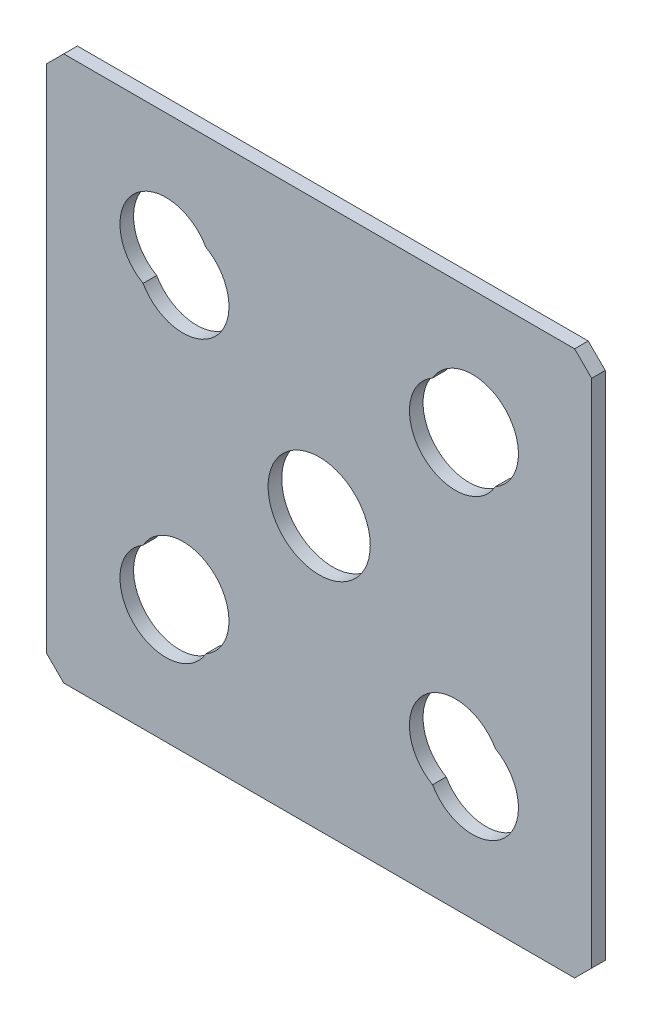
ISO-10303-21;
HEADER;
FILE_DESCRIPTION(('STEP AP214'),'2;1');
FILE_NAME('part.step','',(''),(''),'','','');
FILE_SCHEMA(('AUTOMOTIVE_DESIGN { 1 0 10303 214 1 1 1 1 }'));
ENDSEC;
DATA;
#1=APPLICATION_CONTEXT('core data for automotive mechanical design processes');
#2=APPLICATION_PROTOCOL_DEFINITION('international standard','automotive_design',2000,#1);
#3=PRODUCT_CONTEXT('',#1,'mechanical');
#4=PRODUCT('Part','Part','',(#3));
#5=PRODUCT_RELATED_PRODUCT_CATEGORY('part','',(#4));
#6=PRODUCT_DEFINITION_FORMATION('','',#4);
#7=PRODUCT_DEFINITION_CONTEXT('part definition',#1,'design');
#8=PRODUCT_DEFINITION('design','',#6,#7);
#9=PRODUCT_DEFINITION_SHAPE('','',#8);
#10=(LENGTH_UNIT() NAMED_UNIT(*) SI_UNIT(.MILLI.,.METRE.));
#11=(NAMED_UNIT(*) PLANE_ANGLE_UNIT() SI_UNIT($,.RADIAN.));
#12=(NAMED_UNIT(*) SI_UNIT($,.STERADIAN.) SOLID_ANGLE_UNIT());
#13=UNCERTAINTY_MEASURE_WITH_UNIT(LENGTH_MEASURE(1.E-05),#10,'distance_accuracy_value','');
#14=(GEOMETRIC_REPRESENTATION_CONTEXT(3) GLOBAL_UNCERTAINTY_ASSIGNED_CONTEXT((#13)) GLOBAL_UNIT_ASSIGNED_CONTEXT((#10,
#11,#12)) REPRESENTATION_CONTEXT('',''));
#15=CARTESIAN_POINT('',(0.,0.,0.));
#16=DIRECTION('',(0.,0.,1.));
#17=DIRECTION('',(1.,0.,0.));
#18=AXIS2_PLACEMENT_3D('',#15,#16,#17);
#19=CARTESIAN_POINT('',(-40.,-40.,-2.));
#20=DIRECTION('',(-1.,0.,0.));
#21=DIRECTION('',(0.,0.,1.));
#22=AXIS2_PLACEMENT_3D('',#19,#20,#21);
#23=PLANE('',#22);
#24=DIRECTION('',(0.,-1.,0.));
#25=VECTOR('',#24,1.);
#26=CARTESIAN_POINT('',(-40.,-40.,-2.));
#27=LINE('',#26,#25);
#28=CARTESIAN_POINT('',(-40.,37.5,-2.));
#29=VERTEX_POINT('',#28);
#30=CARTESIAN_POINT('',(-40.,-37.5,-2.));
#31=VERTEX_POINT('',#30);
#32=EDGE_CURVE('E186',#29,#31,#27,.T.);
#33=ORIENTED_EDGE('',*,*,#32,.T.);
#34=DIRECTION('',(0.,0.,1.));
#35=VECTOR('',#34,1.);
#36=CARTESIAN_POINT('',(-40.,-37.5,-2.));
#37=LINE('',#36,#35);
#38=CARTESIAN_POINT('',(-40.,-37.5,0.));
#39=VERTEX_POINT('',#38);
#40=EDGE_CURVE('E11',#31,#39,#37,.T.);
#41=ORIENTED_EDGE('',*,*,#40,.T.);
#42=DIRECTION('',(0.,-1.,0.));
#43=VECTOR('',#42,1.);
#44=CARTESIAN_POINT('',(-40.,-40.,0.));
#45=LINE('',#44,#43);
#46=CARTESIAN_POINT('',(-40.,37.5,0.));
#47=VERTEX_POINT('',#46);
#48=EDGE_CURVE('E178',#47,#39,#45,.T.);
#49=ORIENTED_EDGE('',*,*,#48,.F.);
#50=DIRECTION('',(0.,0.,-1.));
#51=VECTOR('',#50,1.);
#52=CARTESIAN_POINT('',(-40.,37.5,-2.));
#53=LINE('',#52,#51);
#54=EDGE_CURVE('E47',#47,#29,#53,.T.);
#55=ORIENTED_EDGE('',*,*,#54,.T.);
#56=EDGE_LOOP('',(#33,#41,#49,#55));
#57=FACE_BOUND('',#56,.T.);
#58=ADVANCED_FACE('F39',(#57),#23,.T.);
#59=CARTESIAN_POINT('',(40.,40.,-2.));
#60=DIRECTION('',(0.,1.,0.));
#61=DIRECTION('',(-1.,0.,0.));
#62=AXIS2_PLACEMENT_3D('',#59,#60,#61);
#63=PLANE('',#62);
#64=DIRECTION('',(-1.,0.,0.));
#65=VECTOR('',#64,1.);
#66=CARTESIAN_POINT('',(40.,40.,0.));
#67=LINE('',#66,#65);
#68=CARTESIAN_POINT('',(37.5,40.,0.));
#69=VERTEX_POINT('',#68);
#70=CARTESIAN_POINT('',(-37.5,40.,0.));
#71=VERTEX_POINT('',#70);
#72=EDGE_CURVE('E190',#69,#71,#67,.T.);
#73=ORIENTED_EDGE('',*,*,#72,.F.);
#74=DIRECTION('',(0.,0.,-1.));
#75=VECTOR('',#74,1.);
#76=CARTESIAN_POINT('',(37.5,40.,-2.));
#77=LINE('',#76,#75);
#78=CARTESIAN_POINT('',(37.5,40.,-2.));
#79=VERTEX_POINT('',#78);
#80=EDGE_CURVE('E242',#69,#79,#77,.T.);
#81=ORIENTED_EDGE('',*,*,#80,.T.);
#82=DIRECTION('',(-1.,0.,0.));
#83=VECTOR('',#82,1.);
#84=CARTESIAN_POINT('',(40.,40.,-2.));
#85=LINE('',#84,#83);
#86=CARTESIAN_POINT('',(-37.5,40.,-2.));
#87=VERTEX_POINT('',#86);
#88=EDGE_CURVE('E195',#79,#87,#85,.T.);
#89=ORIENTED_EDGE('',*,*,#88,.T.);
#90=DIRECTION('',(0.,0.,1.));
#91=VECTOR('',#90,1.);
#92=CARTESIAN_POINT('',(-37.5,40.,-2.));
#93=LINE('',#92,#91);
#94=EDGE_CURVE('E239',#87,#71,#93,.T.);
#95=ORIENTED_EDGE('',*,*,#94,.T.);
#96=EDGE_LOOP('',(#73,#81,#89,#95));
#97=FACE_BOUND('',#96,.T.);
#98=ADVANCED_FACE('F267',(#97),#63,.T.);
#99=CARTESIAN_POINT('',(40.,-40.,-2.));
#100=DIRECTION('',(1.,0.,0.));
#101=DIRECTION('',(0.,0.,-1.));
#102=AXIS2_PLACEMENT_3D('',#99,#100,#101);
#103=PLANE('',#102);
#104=DIRECTION('',(0.,1.,0.));
#105=VECTOR('',#104,1.);
#106=CARTESIAN_POINT('',(40.,-40.,-2.));
#107=LINE('',#106,#105);
#108=CARTESIAN_POINT('',(40.,-37.5,-2.));
#109=VERTEX_POINT('',#108);
#110=CARTESIAN_POINT('',(40.,37.5,-2.));
#111=VERTEX_POINT('',#110);
#112=EDGE_CURVE('E192',#109,#111,#107,.T.);
#113=ORIENTED_EDGE('',*,*,#112,.T.);
#114=DIRECTION('',(0.,0.,1.));
#115=VECTOR('',#114,1.);
#116=CARTESIAN_POINT('',(40.,37.5,-2.));
#117=LINE('',#116,#115);
#118=CARTESIAN_POINT('',(40.,37.5,0.));
#119=VERTEX_POINT('',#118);
#120=EDGE_CURVE('E228',#111,#119,#117,.T.);
#121=ORIENTED_EDGE('',*,*,#120,.T.);
#122=DIRECTION('',(0.,1.,0.));
#123=VECTOR('',#122,1.);
#124=CARTESIAN_POINT('',(40.,-40.,0.));
#125=LINE('',#124,#123);
#126=CARTESIAN_POINT('',(40.,-37.5,0.));
#127=VERTEX_POINT('',#126);
#128=EDGE_CURVE('E204',#127,#119,#125,.T.);
#129=ORIENTED_EDGE('',*,*,#128,.F.);
#130=DIRECTION('',(0.,0.,-1.));
#131=VECTOR('',#130,1.);
#132=CARTESIAN_POINT('',(40.,-37.5,-2.));
#133=LINE('',#132,#131);
#134=EDGE_CURVE('E172',#127,#109,#133,.T.);
#135=ORIENTED_EDGE('',*,*,#134,.T.);
#136=EDGE_LOOP('',(#113,#121,#129,#135));
#137=FACE_BOUND('',#136,.T.);
#138=ADVANCED_FACE('F276',(#137),#103,.T.);
#139=CARTESIAN_POINT('',(40.,-40.,-2.));
#140=DIRECTION('',(0.,-1.,0.));
#141=DIRECTION('',(1.,0.,0.));
#142=AXIS2_PLACEMENT_3D('',#139,#140,#141);
#143=PLANE('',#142);
#144=DIRECTION('',(1.,0.,0.));
#145=VECTOR('',#144,1.);
#146=CARTESIAN_POINT('',(40.,-40.,-2.));
#147=LINE('',#146,#145);
#148=CARTESIAN_POINT('',(-37.5,-40.,-2.));
#149=VERTEX_POINT('',#148);
#150=CARTESIAN_POINT('',(37.5,-40.,-2.));
#151=VERTEX_POINT('',#150);
#152=EDGE_CURVE('E189',#149,#151,#147,.T.);
#153=ORIENTED_EDGE('',*,*,#152,.T.);
#154=DIRECTION('',(0.,0.,1.));
#155=VECTOR('',#154,1.);
#156=CARTESIAN_POINT('',(37.5,-40.,-2.));
#157=LINE('',#156,#155);
#158=CARTESIAN_POINT('',(37.5,-40.,0.));
#159=VERTEX_POINT('',#158);
#160=EDGE_CURVE('E252',#151,#159,#157,.T.);
#161=ORIENTED_EDGE('',*,*,#160,.T.);
#162=DIRECTION('',(1.,0.,0.));
#163=VECTOR('',#162,1.);
#164=CARTESIAN_POINT('',(40.,-40.,0.));
#165=LINE('',#164,#163);
#166=CARTESIAN_POINT('',(-37.5,-40.,0.));
#167=VERTEX_POINT('',#166);
#168=EDGE_CURVE('E201',#167,#159,#165,.T.);
#169=ORIENTED_EDGE('',*,*,#168,.F.);
#170=DIRECTION('',(0.,0.,-1.));
#171=VECTOR('',#170,1.);
#172=CARTESIAN_POINT('',(-37.5,-40.,-2.));
#173=LINE('',#172,#171);
#174=EDGE_CURVE('E61',#167,#149,#173,.T.);
#175=ORIENTED_EDGE('',*,*,#174,.T.);
#176=EDGE_LOOP('',(#153,#161,#169,#175));
#177=FACE_BOUND('',#176,.T.);
#178=ADVANCED_FACE('F281',(#177),#143,.T.);
#179=CARTESIAN_POINT('',(0.,0.,-2.));
#180=DIRECTION('',(0.,0.,1.));
#181=DIRECTION('',(1.,0.,0.));
#182=AXIS2_PLACEMENT_3D('',#179,#180,#181);
#183=PLANE('',#182);
#184=CARTESIAN_POINT('',(0.,0.,-2.));
#185=DIRECTION('',(0.,0.,1.));
#186=DIRECTION('',(1.,0.,0.));
#187=AXIS2_PLACEMENT_3D('',#184,#185,#186);
#188=CIRCLE('',#187,7.5);
#189=CARTESIAN_POINT('',(7.5,0.,-2.));
#190=VERTEX_POINT('',#189);
#191=EDGE_CURVE('E164',#190,#190,#188,.T.);
#192=ORIENTED_EDGE('',*,*,#191,.T.);
#193=EDGE_LOOP('',(#192));
#194=FACE_BOUND('',#193,.T.);
#195=CARTESIAN_POINT('',(-22.5,22.5,-2.));
#196=DIRECTION('',(0.,0.,1.));
#197=DIRECTION('',(1.,0.,0.));
#198=AXIS2_PLACEMENT_3D('',#195,#196,#197);
#199=CIRCLE('',#198,6.75);
#200=CARTESIAN_POINT('',(-16.643618556828,25.8563814431721,-2.));
#201=VERTEX_POINT('',#200);
#202=CARTESIAN_POINT('',(-25.856381443172,16.6436185568279,-2.));
#203=VERTEX_POINT('',#202);
#204=EDGE_CURVE('E491',#201,#203,#199,.T.);
#205=ORIENTED_EDGE('',*,*,#204,.T.);
#206=CARTESIAN_POINT('',(-20.,20.,-2.));
#207=DIRECTION('',(0.,0.,1.));
#208=DIRECTION('',(1.,0.,0.));
#209=AXIS2_PLACEMENT_3D('',#206,#207,#208);
#210=CIRCLE('',#209,6.75);
#211=EDGE_CURVE('E485',#203,#201,#210,.T.);
#212=ORIENTED_EDGE('',*,*,#211,.T.);
#213=EDGE_LOOP('',(#205,#212));
#214=FACE_BOUND('',#213,.T.);
#215=CARTESIAN_POINT('',(22.5,-22.5,-2.));
#216=DIRECTION('',(0.,0.,1.));
#217=DIRECTION('',(1.,0.,0.));
#218=AXIS2_PLACEMENT_3D('',#215,#216,#217);
#219=CIRCLE('',#218,6.75);
#220=CARTESIAN_POINT('',(16.6436185568279,-25.8563814431721,-2.));
#221=VERTEX_POINT('',#220);
#222=CARTESIAN_POINT('',(25.8563814431721,-16.6436185568279,-2.));
#223=VERTEX_POINT('',#222);
#224=EDGE_CURVE('E496',#221,#223,#219,.T.);
#225=ORIENTED_EDGE('',*,*,#224,.T.);
#226=CARTESIAN_POINT('',(20.,-20.,-2.));
#227=DIRECTION('',(0.,0.,1.));
#228=DIRECTION('',(1.,0.,0.));
#229=AXIS2_PLACEMENT_3D('',#226,#227,#228);
#230=CIRCLE('',#229,6.75);
#231=EDGE_CURVE('E480',#223,#221,#230,.T.);
#232=ORIENTED_EDGE('',*,*,#231,.T.);
#233=EDGE_LOOP('',(#225,#232));
#234=FACE_BOUND('',#233,.T.);
#235=CARTESIAN_POINT('',(22.5,22.5,-2.));
#236=DIRECTION('',(0.,0.,1.));
#237=DIRECTION('',(1.,0.,0.));
#238=AXIS2_PLACEMENT_3D('',#235,#236,#237);
#239=CIRCLE('',#238,6.75);
#240=CARTESIAN_POINT('',(25.8563814431721,16.6436185568279,-2.));
#241=VERTEX_POINT('',#240);
#242=CARTESIAN_POINT('',(16.6436185568279,25.856381443172,-2.));
#243=VERTEX_POINT('',#242);
#244=EDGE_CURVE('E176',#241,#243,#239,.T.);
#245=ORIENTED_EDGE('',*,*,#244,.T.);
#246=CARTESIAN_POINT('',(20.,20.,-2.));
#247=DIRECTION('',(0.,0.,1.));
#248=DIRECTION('',(1.,0.,0.));
#249=AXIS2_PLACEMENT_3D('',#246,#247,#248);
#250=CIRCLE('',#249,6.75);
#251=EDGE_CURVE('E475',#243,#241,#250,.T.);
#252=ORIENTED_EDGE('',*,*,#251,.T.);
#253=EDGE_LOOP('',(#245,#252));
#254=FACE_BOUND('',#253,.T.);
#255=CARTESIAN_POINT('',(-22.5,-22.5,-2.));
#256=DIRECTION('',(0.,0.,1.));
#257=DIRECTION('',(1.,0.,0.));
#258=AXIS2_PLACEMENT_3D('',#255,#256,#257);
#259=CIRCLE('',#258,6.75);
#260=CARTESIAN_POINT('',(-25.8563814431721,-16.6436185568279,-2.));
#261=VERTEX_POINT('',#260);
#262=CARTESIAN_POINT('',(-16.643618556828,-25.8563814431721,-2.));
#263=VERTEX_POINT('',#262);
#264=EDGE_CURVE('E171',#261,#263,#259,.T.);
#265=ORIENTED_EDGE('',*,*,#264,.T.);
#266=CARTESIAN_POINT('',(-20.,-20.,-2.));
#267=DIRECTION('',(0.,0.,1.));
#268=DIRECTION('',(1.,0.,0.));
#269=AXIS2_PLACEMENT_3D('',#266,#267,#268);
#270=CIRCLE('',#269,6.75);
#271=EDGE_CURVE('E163',#263,#261,#270,.T.);
#272=ORIENTED_EDGE('',*,*,#271,.T.);
#273=EDGE_LOOP('',(#265,#272));
#274=FACE_BOUND('',#273,.T.);
#275=ORIENTED_EDGE('',*,*,#88,.F.);
#276=DIRECTION('',(-0.707106781186548,0.707106781186548,0.));
#277=VECTOR('',#276,1.);
#278=CARTESIAN_POINT('',(40.,37.5,-2.));
#279=LINE('',#278,#277);
#280=EDGE_CURVE('E249',#79,#111,#279,.F.);
#281=ORIENTED_EDGE('',*,*,#280,.T.);
#282=ORIENTED_EDGE('',*,*,#112,.F.);
#283=DIRECTION('',(0.707106781186546,0.707106781186549,0.));
#284=VECTOR('',#283,1.);
#285=CARTESIAN_POINT('',(37.5,-40.,-2.));
#286=LINE('',#285,#284);
#287=EDGE_CURVE('E54',#109,#151,#286,.F.);
#288=ORIENTED_EDGE('',*,*,#287,.T.);
#289=ORIENTED_EDGE('',*,*,#152,.F.);
#290=DIRECTION('',(0.707106781186548,-0.707106781186548,0.));
#291=VECTOR('',#290,1.);
#292=CARTESIAN_POINT('',(-40.,-37.5,-2.));
#293=LINE('',#292,#291);
#294=EDGE_CURVE('E246',#149,#31,#293,.F.);
#295=ORIENTED_EDGE('',*,*,#294,.T.);
#296=ORIENTED_EDGE('',*,*,#32,.F.);
#297=DIRECTION('',(-0.707106781186545,-0.70710678118655,0.));
#298=VECTOR('',#297,1.);
#299=CARTESIAN_POINT('',(-37.5,40.,-2.));
#300=LINE('',#299,#298);
#301=EDGE_CURVE('E244',#29,#87,#300,.F.);
#302=ORIENTED_EDGE('',*,*,#301,.T.);
#303=EDGE_LOOP('',(#275,#281,#282,#288,#289,#295,#296,#302));
#304=FACE_BOUND('',#303,.T.);
#305=ADVANCED_FACE('F262',(#194,#214,#234,#254,#274,#304),#183,.F.);
#306=CARTESIAN_POINT('',(0.,0.,0.));
#307=DIRECTION('',(0.,0.,1.));
#308=DIRECTION('',(1.,0.,0.));
#309=AXIS2_PLACEMENT_3D('',#306,#307,#308);
#310=PLANE('',#309);
#311=CARTESIAN_POINT('',(0.,0.,0.));
#312=DIRECTION('',(0.,0.,1.));
#313=DIRECTION('',(1.,0.,0.));
#314=AXIS2_PLACEMENT_3D('',#311,#312,#313);
#315=CIRCLE('',#314,7.5);
#316=CARTESIAN_POINT('',(7.5,0.,0.));
#317=VERTEX_POINT('',#316);
#318=EDGE_CURVE('E467',#317,#317,#315,.T.);
#319=ORIENTED_EDGE('',*,*,#318,.F.);
#320=EDGE_LOOP('',(#319));
#321=FACE_BOUND('',#320,.T.);
#322=CARTESIAN_POINT('',(-20.,-20.,0.));
#323=DIRECTION('',(0.,0.,1.));
#324=DIRECTION('',(1.,0.,0.));
#325=AXIS2_PLACEMENT_3D('',#322,#323,#324);
#326=CIRCLE('',#325,6.75);
#327=CARTESIAN_POINT('',(-16.643618556828,-25.8563814431721,0.));
#328=VERTEX_POINT('',#327);
#329=CARTESIAN_POINT('',(-25.8563814431721,-16.6436185568279,0.));
#330=VERTEX_POINT('',#329);
#331=EDGE_CURVE('E153',#328,#330,#326,.T.);
#332=ORIENTED_EDGE('',*,*,#331,.F.);
#333=CARTESIAN_POINT('',(-22.5,-22.5,0.));
#334=DIRECTION('',(0.,0.,1.));
#335=DIRECTION('',(1.,0.,0.));
#336=AXIS2_PLACEMENT_3D('',#333,#334,#335);
#337=CIRCLE('',#336,6.75);
#338=EDGE_CURVE('E169',#330,#328,#337,.T.);
#339=ORIENTED_EDGE('',*,*,#338,.F.);
#340=EDGE_LOOP('',(#332,#339));
#341=FACE_BOUND('',#340,.T.);
#342=CARTESIAN_POINT('',(20.,20.,0.));
#343=DIRECTION('',(0.,0.,1.));
#344=DIRECTION('',(1.,0.,0.));
#345=AXIS2_PLACEMENT_3D('',#342,#343,#344);
#346=CIRCLE('',#345,6.75);
#347=CARTESIAN_POINT('',(16.6436185568279,25.856381443172,0.));
#348=VERTEX_POINT('',#347);
#349=CARTESIAN_POINT('',(25.8563814431721,16.6436185568279,0.));
#350=VERTEX_POINT('',#349);
#351=EDGE_CURVE('E473',#348,#350,#346,.T.);
#352=ORIENTED_EDGE('',*,*,#351,.F.);
#353=CARTESIAN_POINT('',(22.5,22.5,0.));
#354=DIRECTION('',(0.,0.,1.));
#355=DIRECTION('',(1.,0.,0.));
#356=AXIS2_PLACEMENT_3D('',#353,#354,#355);
#357=CIRCLE('',#356,6.75);
#358=EDGE_CURVE('E181',#350,#348,#357,.T.);
#359=ORIENTED_EDGE('',*,*,#358,.F.);
#360=EDGE_LOOP('',(#352,#359));
#361=FACE_BOUND('',#360,.T.);
#362=CARTESIAN_POINT('',(20.,-20.,0.));
#363=DIRECTION('',(0.,0.,1.));
#364=DIRECTION('',(1.,0.,0.));
#365=AXIS2_PLACEMENT_3D('',#362,#363,#364);
#366=CIRCLE('',#365,6.75);
#367=CARTESIAN_POINT('',(25.8563814431721,-16.6436185568279,0.));
#368=VERTEX_POINT('',#367);
#369=CARTESIAN_POINT('',(16.6436185568279,-25.8563814431721,0.));
#370=VERTEX_POINT('',#369);
#371=EDGE_CURVE('E478',#368,#370,#366,.T.);
#372=ORIENTED_EDGE('',*,*,#371,.F.);
#373=CARTESIAN_POINT('',(22.5,-22.5,0.));
#374=DIRECTION('',(0.,0.,1.));
#375=DIRECTION('',(1.,0.,0.));
#376=AXIS2_PLACEMENT_3D('',#373,#374,#375);
#377=CIRCLE('',#376,6.75);
#378=EDGE_CURVE('E494',#370,#368,#377,.T.);
#379=ORIENTED_EDGE('',*,*,#378,.F.);
#380=EDGE_LOOP('',(#372,#379));
#381=FACE_BOUND('',#380,.T.);
#382=CARTESIAN_POINT('',(-20.,20.,0.));
#383=DIRECTION('',(0.,0.,1.));
#384=DIRECTION('',(1.,0.,0.));
#385=AXIS2_PLACEMENT_3D('',#382,#383,#384);
#386=CIRCLE('',#385,6.75);
#387=CARTESIAN_POINT('',(-25.856381443172,16.6436185568279,0.));
#388=VERTEX_POINT('',#387);
#389=CARTESIAN_POINT('',(-16.643618556828,25.8563814431721,0.));
#390=VERTEX_POINT('',#389);
#391=EDGE_CURVE('E483',#388,#390,#386,.T.);
#392=ORIENTED_EDGE('',*,*,#391,.F.);
#393=CARTESIAN_POINT('',(-22.5,22.5,0.));
#394=DIRECTION('',(0.,0.,1.));
#395=DIRECTION('',(1.,0.,0.));
#396=AXIS2_PLACEMENT_3D('',#393,#394,#395);
#397=CIRCLE('',#396,6.75);
#398=EDGE_CURVE('E488',#390,#388,#397,.T.);
#399=ORIENTED_EDGE('',*,*,#398,.F.);
#400=EDGE_LOOP('',(#392,#399));
#401=FACE_BOUND('',#400,.T.);
#402=ORIENTED_EDGE('',*,*,#128,.T.);
#403=DIRECTION('',(0.707106781186548,-0.707106781186548,0.));
#404=VECTOR('',#403,1.);
#405=CARTESIAN_POINT('',(38.75,38.75,0.));
#406=LINE('',#405,#404);
#407=EDGE_CURVE('E237',#119,#69,#406,.F.);
#408=ORIENTED_EDGE('',*,*,#407,.T.);
#409=ORIENTED_EDGE('',*,*,#72,.T.);
#410=DIRECTION('',(0.707106781186545,0.70710678118655,0.));
#411=VECTOR('',#410,1.);
#412=CARTESIAN_POINT('',(-38.7500000000001,38.7499999999998,0.));
#413=LINE('',#412,#411);
#414=EDGE_CURVE('E231',#71,#47,#413,.F.);
#415=ORIENTED_EDGE('',*,*,#414,.T.);
#416=ORIENTED_EDGE('',*,*,#48,.T.);
#417=DIRECTION('',(-0.707106781186548,0.707106781186548,0.));
#418=VECTOR('',#417,1.);
#419=CARTESIAN_POINT('',(-38.75,-38.75,0.));
#420=LINE('',#419,#418);
#421=EDGE_CURVE('E233',#39,#167,#420,.F.);
#422=ORIENTED_EDGE('',*,*,#421,.T.);
#423=ORIENTED_EDGE('',*,*,#168,.T.);
#424=DIRECTION('',(-0.707106781186546,-0.707106781186549,0.));
#425=VECTOR('',#424,1.);
#426=CARTESIAN_POINT('',(38.7500000000001,-38.7499999999999,0.));
#427=LINE('',#426,#425);
#428=EDGE_CURVE('E235',#159,#127,#427,.F.);
#429=ORIENTED_EDGE('',*,*,#428,.T.);
#430=EDGE_LOOP('',(#402,#408,#409,#415,#416,#422,#423,#429));
#431=FACE_BOUND('',#430,.T.);
#432=ADVANCED_FACE('F174',(#321,#341,#361,#381,#401,#431),#310,.T.);
#433=CARTESIAN_POINT('',(-22.5,-22.5,0.));
#434=DIRECTION('',(0.,0.,1.));
#435=DIRECTION('',(1.,0.,0.));
#436=AXIS2_PLACEMENT_3D('',#433,#434,#435);
#437=CYLINDRICAL_SURFACE('',#436,6.75);
#438=ORIENTED_EDGE('',*,*,#264,.F.);
#439=DIRECTION('',(0.,0.,1.));
#440=VECTOR('',#439,1.);
#441=CARTESIAN_POINT('',(-25.8563814431721,-16.6436185568279,-11.125));
#442=LINE('',#441,#440);
#443=EDGE_CURVE('E156',#261,#330,#442,.T.);
#444=ORIENTED_EDGE('',*,*,#443,.T.);
#445=ORIENTED_EDGE('',*,*,#338,.T.);
#446=DIRECTION('',(0.,0.,1.));
#447=VECTOR('',#446,1.);
#448=CARTESIAN_POINT('',(-16.643618556828,-25.8563814431721,-11.125));
#449=LINE('',#448,#447);
#450=EDGE_CURVE('E159',#328,#263,#449,.F.);
#451=ORIENTED_EDGE('',*,*,#450,.T.);
#452=EDGE_LOOP('',(#438,#444,#445,#451));
#453=FACE_BOUND('',#452,.T.);
#454=ADVANCED_FACE('F168',(#453),#437,.F.);
#455=CARTESIAN_POINT('',(22.5,22.5,0.));
#456=DIRECTION('',(0.,0.,1.));
#457=DIRECTION('',(1.,0.,0.));
#458=AXIS2_PLACEMENT_3D('',#455,#456,#457);
#459=CYLINDRICAL_SURFACE('',#458,6.75);
#460=ORIENTED_EDGE('',*,*,#244,.F.);
#461=DIRECTION('',(0.,0.,1.));
#462=VECTOR('',#461,1.);
#463=CARTESIAN_POINT('',(25.8563814431721,16.6436185568279,-11.125));
#464=LINE('',#463,#462);
#465=EDGE_CURVE('E223',#241,#350,#464,.T.);
#466=ORIENTED_EDGE('',*,*,#465,.T.);
#467=ORIENTED_EDGE('',*,*,#358,.T.);
#468=DIRECTION('',(0.,0.,1.));
#469=VECTOR('',#468,1.);
#470=CARTESIAN_POINT('',(16.6436185568279,25.856381443172,-11.125));
#471=LINE('',#470,#469);
#472=EDGE_CURVE('E220',#348,#243,#471,.F.);
#473=ORIENTED_EDGE('',*,*,#472,.T.);
#474=EDGE_LOOP('',(#460,#466,#467,#473));
#475=FACE_BOUND('',#474,.T.);
#476=ADVANCED_FACE('F332',(#475),#459,.F.);
#477=CARTESIAN_POINT('',(22.5,-22.5,0.));
#478=DIRECTION('',(0.,0.,1.));
#479=DIRECTION('',(1.,0.,0.));
#480=AXIS2_PLACEMENT_3D('',#477,#478,#479);
#481=CYLINDRICAL_SURFACE('',#480,6.75);
#482=ORIENTED_EDGE('',*,*,#224,.F.);
#483=DIRECTION('',(0.,0.,1.));
#484=VECTOR('',#483,1.);
#485=CARTESIAN_POINT('',(16.6436185568279,-25.8563814431721,-11.125));
#486=LINE('',#485,#484);
#487=EDGE_CURVE('E217',#221,#370,#486,.T.);
#488=ORIENTED_EDGE('',*,*,#487,.T.);
#489=ORIENTED_EDGE('',*,*,#378,.T.);
#490=DIRECTION('',(0.,0.,1.));
#491=VECTOR('',#490,1.);
#492=CARTESIAN_POINT('',(25.8563814431721,-16.6436185568279,-11.125));
#493=LINE('',#492,#491);
#494=EDGE_CURVE('E214',#368,#223,#493,.F.);
#495=ORIENTED_EDGE('',*,*,#494,.T.);
#496=EDGE_LOOP('',(#482,#488,#489,#495));
#497=FACE_BOUND('',#496,.T.);
#498=ADVANCED_FACE('F328',(#497),#481,.F.);
#499=CARTESIAN_POINT('',(-22.5,22.5,0.));
#500=DIRECTION('',(0.,0.,1.));
#501=DIRECTION('',(1.,0.,0.));
#502=AXIS2_PLACEMENT_3D('',#499,#500,#501);
#503=CYLINDRICAL_SURFACE('',#502,6.75);
#504=ORIENTED_EDGE('',*,*,#204,.F.);
#505=DIRECTION('',(0.,0.,1.));
#506=VECTOR('',#505,1.);
#507=CARTESIAN_POINT('',(-16.643618556828,25.8563814431721,-11.125));
#508=LINE('',#507,#506);
#509=EDGE_CURVE('E211',#201,#390,#508,.T.);
#510=ORIENTED_EDGE('',*,*,#509,.T.);
#511=ORIENTED_EDGE('',*,*,#398,.T.);
#512=DIRECTION('',(0.,0.,1.));
#513=VECTOR('',#512,1.);
#514=CARTESIAN_POINT('',(-25.856381443172,16.6436185568279,-11.125));
#515=LINE('',#514,#513);
#516=EDGE_CURVE('E198',#388,#203,#515,.F.);
#517=ORIENTED_EDGE('',*,*,#516,.T.);
#518=EDGE_LOOP('',(#504,#510,#511,#517));
#519=FACE_BOUND('',#518,.T.);
#520=ADVANCED_FACE('F324',(#519),#503,.F.);
#521=CARTESIAN_POINT('',(-20.,20.,0.));
#522=DIRECTION('',(0.,0.,1.));
#523=DIRECTION('',(1.,0.,0.));
#524=AXIS2_PLACEMENT_3D('',#521,#522,#523);
#525=CYLINDRICAL_SURFACE('',#524,6.75);
#526=ORIENTED_EDGE('',*,*,#211,.F.);
#527=ORIENTED_EDGE('',*,*,#516,.F.);
#528=ORIENTED_EDGE('',*,*,#391,.T.);
#529=ORIENTED_EDGE('',*,*,#509,.F.);
#530=EDGE_LOOP('',(#526,#527,#528,#529));
#531=FACE_BOUND('',#530,.T.);
#532=ADVANCED_FACE('F320',(#531),#525,.F.);
#533=CARTESIAN_POINT('',(20.,-20.,0.));
#534=DIRECTION('',(0.,0.,1.));
#535=DIRECTION('',(1.,0.,0.));
#536=AXIS2_PLACEMENT_3D('',#533,#534,#535);
#537=CYLINDRICAL_SURFACE('',#536,6.75);
#538=ORIENTED_EDGE('',*,*,#231,.F.);
#539=ORIENTED_EDGE('',*,*,#494,.F.);
#540=ORIENTED_EDGE('',*,*,#371,.T.);
#541=ORIENTED_EDGE('',*,*,#487,.F.);
#542=EDGE_LOOP('',(#538,#539,#540,#541));
#543=FACE_BOUND('',#542,.T.);
#544=ADVANCED_FACE('F316',(#543),#537,.F.);
#545=CARTESIAN_POINT('',(20.,20.,0.));
#546=DIRECTION('',(0.,0.,1.));
#547=DIRECTION('',(1.,0.,0.));
#548=AXIS2_PLACEMENT_3D('',#545,#546,#547);
#549=CYLINDRICAL_SURFACE('',#548,6.75);
#550=ORIENTED_EDGE('',*,*,#251,.F.);
#551=ORIENTED_EDGE('',*,*,#472,.F.);
#552=ORIENTED_EDGE('',*,*,#351,.T.);
#553=ORIENTED_EDGE('',*,*,#465,.F.);
#554=EDGE_LOOP('',(#550,#551,#552,#553));
#555=FACE_BOUND('',#554,.T.);
#556=ADVANCED_FACE('F309',(#555),#549,.F.);
#557=CARTESIAN_POINT('',(-20.,-20.,0.));
#558=DIRECTION('',(0.,0.,1.));
#559=DIRECTION('',(1.,0.,0.));
#560=AXIS2_PLACEMENT_3D('',#557,#558,#559);
#561=CYLINDRICAL_SURFACE('',#560,6.75);
#562=ORIENTED_EDGE('',*,*,#271,.F.);
#563=ORIENTED_EDGE('',*,*,#450,.F.);
#564=ORIENTED_EDGE('',*,*,#331,.T.);
#565=ORIENTED_EDGE('',*,*,#443,.F.);
#566=EDGE_LOOP('',(#562,#563,#564,#565));
#567=FACE_BOUND('',#566,.T.);
#568=ADVANCED_FACE('F155',(#567),#561,.F.);
#569=CARTESIAN_POINT('',(0.,0.,-10.));
#570=DIRECTION('',(0.,0.,1.));
#571=DIRECTION('',(1.,0.,0.));
#572=AXIS2_PLACEMENT_3D('',#569,#570,#571);
#573=CYLINDRICAL_SURFACE('',#572,7.5);
#574=ORIENTED_EDGE('',*,*,#318,.T.);
#575=EDGE_LOOP('',(#574));
#576=FACE_BOUND('',#575,.T.);
#577=ORIENTED_EDGE('',*,*,#191,.F.);
#578=EDGE_LOOP('',(#577));
#579=FACE_BOUND('',#578,.T.);
#580=ADVANCED_FACE('F300',(#576,#579),#573,.F.);
#581=CARTESIAN_POINT('',(40.,37.5,-2.));
#582=DIRECTION('',(-0.707106781186547,-0.707106781186547,0.));
#583=DIRECTION('',(0.,0.,1.));
#584=AXIS2_PLACEMENT_3D('',#581,#582,#583);
#585=PLANE('',#584);
#586=ORIENTED_EDGE('',*,*,#280,.F.);
#587=ORIENTED_EDGE('',*,*,#80,.F.);
#588=ORIENTED_EDGE('',*,*,#407,.F.);
#589=ORIENTED_EDGE('',*,*,#120,.F.);
#590=EDGE_LOOP('',(#586,#587,#588,#589));
#591=FACE_BOUND('',#590,.T.);
#592=ADVANCED_FACE('F274',(#591),#585,.F.);
#593=CARTESIAN_POINT('',(37.5,-40.,-2.));
#594=DIRECTION('',(-0.707106781186549,0.707106781186545,0.));
#595=DIRECTION('',(0.,0.,1.));
#596=AXIS2_PLACEMENT_3D('',#593,#594,#595);
#597=PLANE('',#596);
#598=ORIENTED_EDGE('',*,*,#287,.F.);
#599=ORIENTED_EDGE('',*,*,#134,.F.);
#600=ORIENTED_EDGE('',*,*,#428,.F.);
#601=ORIENTED_EDGE('',*,*,#160,.F.);
#602=EDGE_LOOP('',(#598,#599,#600,#601));
#603=FACE_BOUND('',#602,.T.);
#604=ADVANCED_FACE('F280',(#603),#597,.F.);
#605=CARTESIAN_POINT('',(-40.,-37.5,-2.));
#606=DIRECTION('',(0.707106781186547,0.707106781186547,0.));
#607=DIRECTION('',(0.,0.,1.));
#608=AXIS2_PLACEMENT_3D('',#605,#606,#607);
#609=PLANE('',#608);
#610=ORIENTED_EDGE('',*,*,#294,.F.);
#611=ORIENTED_EDGE('',*,*,#174,.F.);
#612=ORIENTED_EDGE('',*,*,#421,.F.);
#613=ORIENTED_EDGE('',*,*,#40,.F.);
#614=EDGE_LOOP('',(#610,#611,#612,#613));
#615=FACE_BOUND('',#614,.T.);
#616=ADVANCED_FACE('F283',(#615),#609,.F.);
#617=CARTESIAN_POINT('',(-37.5,40.,-2.));
#618=DIRECTION('',(0.70710678118655,-0.707106781186544,0.));
#619=DIRECTION('',(0.,0.,1.));
#620=AXIS2_PLACEMENT_3D('',#617,#618,#619);
#621=PLANE('',#620);
#622=ORIENTED_EDGE('',*,*,#301,.F.);
#623=ORIENTED_EDGE('',*,*,#54,.F.);
#624=ORIENTED_EDGE('',*,*,#414,.F.);
#625=ORIENTED_EDGE('',*,*,#94,.F.);
#626=EDGE_LOOP('',(#622,#623,#624,#625));
#627=FACE_BOUND('',#626,.T.);
#628=ADVANCED_FACE('F41',(#627),#621,.F.);
#629=CLOSED_SHELL('',(#58,#98,#138,#178,#305,#432,#454,#476,#498,#520,#532,#544,#556,#568,#580,
#592,#604,#616,#628));
#630=MANIFOLD_SOLID_BREP('B2',#629);
#631=ADVANCED_BREP_SHAPE_REPRESENTATION('',(#18,#630),#14);
#632=SHAPE_DEFINITION_REPRESENTATION(#9,#631);
ENDSEC;
END-ISO-10303-21;
